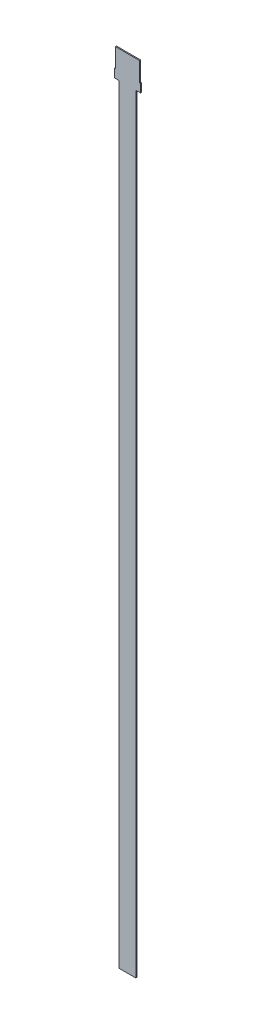
ISO-10303-21;
HEADER;
FILE_DESCRIPTION(('STEP AP214'),'2;1');
FILE_NAME('part.step','',(''),(''),'','','');
FILE_SCHEMA(('AUTOMOTIVE_DESIGN { 1 0 10303 214 1 1 1 1 }'));
ENDSEC;
DATA;
#1=APPLICATION_CONTEXT('core data for automotive mechanical design processes');
#2=APPLICATION_PROTOCOL_DEFINITION('international standard','automotive_design',2000,#1);
#3=PRODUCT_CONTEXT('',#1,'mechanical');
#4=PRODUCT('Part','Part','',(#3));
#5=PRODUCT_RELATED_PRODUCT_CATEGORY('part','',(#4));
#6=PRODUCT_DEFINITION_FORMATION('','',#4);
#7=PRODUCT_DEFINITION_CONTEXT('part definition',#1,'design');
#8=PRODUCT_DEFINITION('design','',#6,#7);
#9=PRODUCT_DEFINITION_SHAPE('','',#8);
#10=(LENGTH_UNIT() NAMED_UNIT(*) SI_UNIT(.MILLI.,.METRE.));
#11=(NAMED_UNIT(*) PLANE_ANGLE_UNIT() SI_UNIT($,.RADIAN.));
#12=(NAMED_UNIT(*) SI_UNIT($,.STERADIAN.) SOLID_ANGLE_UNIT());
#13=UNCERTAINTY_MEASURE_WITH_UNIT(LENGTH_MEASURE(1.E-05),#10,'distance_accuracy_value','');
#14=(GEOMETRIC_REPRESENTATION_CONTEXT(3) GLOBAL_UNCERTAINTY_ASSIGNED_CONTEXT((#13)) GLOBAL_UNIT_ASSIGNED_CONTEXT((#10,
#11,#12)) REPRESENTATION_CONTEXT('',''));
#15=CARTESIAN_POINT('',(0.,0.,0.));
#16=DIRECTION('',(0.,0.,1.));
#17=DIRECTION('',(1.,0.,0.));
#18=AXIS2_PLACEMENT_3D('',#15,#16,#17);
#19=CARTESIAN_POINT('',(-6.35,-607.6,0.396875));
#20=DIRECTION('',(0.,1.,0.));
#21=DIRECTION('',(0.,0.,1.));
#22=AXIS2_PLACEMENT_3D('',#19,#20,#21);
#23=PLANE('',#22);
#24=DIRECTION('',(1.,0.,0.));
#25=VECTOR('',#24,1.);
#26=CARTESIAN_POINT('',(-6.35,-607.6,-0.396875));
#27=LINE('',#26,#25);
#28=CARTESIAN_POINT('',(-6.35,-607.6,-0.396875));
#29=VERTEX_POINT('',#28);
#30=CARTESIAN_POINT('',(6.35,-607.6,-0.396875));
#31=VERTEX_POINT('',#30);
#32=EDGE_CURVE('E152',#29,#31,#27,.T.);
#33=ORIENTED_EDGE('',*,*,#32,.T.);
#34=DIRECTION('',(0.,0.,-1.));
#35=VECTOR('',#34,1.);
#36=CARTESIAN_POINT('',(6.35,-607.6,0.396875));
#37=LINE('',#36,#35);
#38=CARTESIAN_POINT('',(6.35,-607.6,0.396875));
#39=VERTEX_POINT('',#38);
#40=EDGE_CURVE('E11',#39,#31,#37,.T.);
#41=ORIENTED_EDGE('',*,*,#40,.F.);
#42=DIRECTION('',(1.,0.,0.));
#43=VECTOR('',#42,1.);
#44=CARTESIAN_POINT('',(-6.35,-607.6,0.396875));
#45=LINE('',#44,#43);
#46=CARTESIAN_POINT('',(-6.35,-607.6,0.396875));
#47=VERTEX_POINT('',#46);
#48=EDGE_CURVE('E99',#47,#39,#45,.T.);
#49=ORIENTED_EDGE('',*,*,#48,.F.);
#50=DIRECTION('',(0.,0.,-1.));
#51=VECTOR('',#50,1.);
#52=CARTESIAN_POINT('',(-6.35,-607.6,0.396875));
#53=LINE('',#52,#51);
#54=EDGE_CURVE('E49',#47,#29,#53,.T.);
#55=ORIENTED_EDGE('',*,*,#54,.T.);
#56=EDGE_LOOP('',(#33,#41,#49,#55));
#57=FACE_BOUND('',#56,.T.);
#58=ADVANCED_FACE('F33',(#57),#23,.F.);
#59=CARTESIAN_POINT('',(6.35,-21.05,0.396875));
#60=DIRECTION('',(1.,0.,0.));
#61=DIRECTION('',(0.,0.,-1.));
#62=AXIS2_PLACEMENT_3D('',#59,#60,#61);
#63=PLANE('',#62);
#64=DIRECTION('',(0.,-1.,0.));
#65=VECTOR('',#64,1.);
#66=CARTESIAN_POINT('',(6.35,-21.05,-0.396875));
#67=LINE('',#66,#65);
#68=CARTESIAN_POINT('',(6.35,-21.05,-0.396875));
#69=VERTEX_POINT('',#68);
#70=EDGE_CURVE('E154',#69,#31,#67,.T.);
#71=ORIENTED_EDGE('',*,*,#70,.F.);
#72=DIRECTION('',(0.,0.,-1.));
#73=VECTOR('',#72,1.);
#74=CARTESIAN_POINT('',(6.35,-21.05,0.396875));
#75=LINE('',#74,#73);
#76=CARTESIAN_POINT('',(6.35,-21.05,0.396875));
#77=VERTEX_POINT('',#76);
#78=EDGE_CURVE('E41',#77,#69,#75,.T.);
#79=ORIENTED_EDGE('',*,*,#78,.F.);
#80=DIRECTION('',(0.,-1.,0.));
#81=VECTOR('',#80,1.);
#82=CARTESIAN_POINT('',(6.35,-21.05,0.396875));
#83=LINE('',#82,#81);
#84=EDGE_CURVE('E218',#77,#39,#83,.T.);
#85=ORIENTED_EDGE('',*,*,#84,.T.);
#86=ORIENTED_EDGE('',*,*,#40,.T.);
#87=EDGE_LOOP('',(#71,#79,#85,#86));
#88=FACE_BOUND('',#87,.T.);
#89=ADVANCED_FACE('F206',(#88),#63,.T.);
#90=CARTESIAN_POINT('',(9.9695,-21.05,0.396875));
#91=DIRECTION('',(0.,-1.,0.));
#92=DIRECTION('',(1.,0.,0.));
#93=AXIS2_PLACEMENT_3D('',#90,#91,#92);
#94=PLANE('',#93);
#95=DIRECTION('',(-1.,0.,0.));
#96=VECTOR('',#95,1.);
#97=CARTESIAN_POINT('',(9.9695,-21.05,-0.396875));
#98=LINE('',#97,#96);
#99=CARTESIAN_POINT('',(9.9695,-21.05,-0.396875));
#100=VERTEX_POINT('',#99);
#101=EDGE_CURVE('E157',#100,#69,#98,.T.);
#102=ORIENTED_EDGE('',*,*,#101,.F.);
#103=DIRECTION('',(0.,0.,-1.));
#104=VECTOR('',#103,1.);
#105=CARTESIAN_POINT('',(9.9695,-21.05,0.396875));
#106=LINE('',#105,#104);
#107=CARTESIAN_POINT('',(9.9695,-21.05,0.396875));
#108=VERTEX_POINT('',#107);
#109=EDGE_CURVE('E196',#108,#100,#106,.T.);
#110=ORIENTED_EDGE('',*,*,#109,.F.);
#111=DIRECTION('',(-1.,0.,0.));
#112=VECTOR('',#111,1.);
#113=CARTESIAN_POINT('',(9.9695,-21.05,0.396875));
#114=LINE('',#113,#112);
#115=EDGE_CURVE('E203',#108,#77,#114,.T.);
#116=ORIENTED_EDGE('',*,*,#115,.T.);
#117=ORIENTED_EDGE('',*,*,#78,.T.);
#118=EDGE_LOOP('',(#102,#110,#116,#117));
#119=FACE_BOUND('',#118,.T.);
#120=ADVANCED_FACE('F201',(#119),#94,.T.);
#121=CARTESIAN_POINT('',(9.9695,-14.7,0.396875));
#122=DIRECTION('',(1.,0.,0.));
#123=DIRECTION('',(0.,0.,-1.));
#124=AXIS2_PLACEMENT_3D('',#121,#122,#123);
#125=PLANE('',#124);
#126=DIRECTION('',(0.,-1.,0.));
#127=VECTOR('',#126,1.);
#128=CARTESIAN_POINT('',(9.9695,-14.7,-0.396875));
#129=LINE('',#128,#127);
#130=CARTESIAN_POINT('',(9.9695,-14.7,-0.396875));
#131=VERTEX_POINT('',#130);
#132=EDGE_CURVE('E160',#131,#100,#129,.T.);
#133=ORIENTED_EDGE('',*,*,#132,.F.);
#134=DIRECTION('',(0.,0.,-1.));
#135=VECTOR('',#134,1.);
#136=CARTESIAN_POINT('',(9.9695,-14.7,0.396875));
#137=LINE('',#136,#135);
#138=CARTESIAN_POINT('',(9.9695,-14.7,0.396875));
#139=VERTEX_POINT('',#138);
#140=EDGE_CURVE('E194',#139,#131,#137,.T.);
#141=ORIENTED_EDGE('',*,*,#140,.F.);
#142=DIRECTION('',(0.,-1.,0.));
#143=VECTOR('',#142,1.);
#144=CARTESIAN_POINT('',(9.9695,-14.7,0.396875));
#145=LINE('',#144,#143);
#146=EDGE_CURVE('E215',#139,#108,#145,.T.);
#147=ORIENTED_EDGE('',*,*,#146,.T.);
#148=ORIENTED_EDGE('',*,*,#109,.T.);
#149=EDGE_LOOP('',(#133,#141,#147,#148));
#150=FACE_BOUND('',#149,.T.);
#151=ADVANCED_FACE('F212',(#150),#125,.T.);
#152=CARTESIAN_POINT('',(9.17750000000001,-14.7,0.396875));
#153=DIRECTION('',(0.,1.,0.));
#154=DIRECTION('',(-1.,0.,0.));
#155=AXIS2_PLACEMENT_3D('',#152,#153,#154);
#156=PLANE('',#155);
#157=DIRECTION('',(1.,0.,0.));
#158=VECTOR('',#157,1.);
#159=CARTESIAN_POINT('',(9.17750000000001,-14.7,-0.396875));
#160=LINE('',#159,#158);
#161=CARTESIAN_POINT('',(9.17750000000001,-14.7,-0.396875));
#162=VERTEX_POINT('',#161);
#163=EDGE_CURVE('E163',#162,#131,#160,.T.);
#164=ORIENTED_EDGE('',*,*,#163,.F.);
#165=DIRECTION('',(0.,0.,-1.));
#166=VECTOR('',#165,1.);
#167=CARTESIAN_POINT('',(9.17750000000001,-14.7,0.396875));
#168=LINE('',#167,#166);
#169=CARTESIAN_POINT('',(9.17750000000001,-14.7,0.396875));
#170=VERTEX_POINT('',#169);
#171=EDGE_CURVE('E192',#170,#162,#168,.T.);
#172=ORIENTED_EDGE('',*,*,#171,.F.);
#173=DIRECTION('',(1.,0.,0.));
#174=VECTOR('',#173,1.);
#175=CARTESIAN_POINT('',(9.17750000000001,-14.7,0.396875));
#176=LINE('',#175,#174);
#177=EDGE_CURVE('E220',#170,#139,#176,.T.);
#178=ORIENTED_EDGE('',*,*,#177,.T.);
#179=ORIENTED_EDGE('',*,*,#140,.T.);
#180=EDGE_LOOP('',(#164,#172,#178,#179));
#181=FACE_BOUND('',#180,.T.);
#182=ADVANCED_FACE('F264',(#181),#156,.T.);
#183=CARTESIAN_POINT('',(9.17750000000001,0.,0.396875));
#184=DIRECTION('',(1.,0.,0.));
#185=DIRECTION('',(0.,0.,-1.));
#186=AXIS2_PLACEMENT_3D('',#183,#184,#185);
#187=PLANE('',#186);
#188=DIRECTION('',(0.,-1.,0.));
#189=VECTOR('',#188,1.);
#190=CARTESIAN_POINT('',(9.17750000000001,0.,-0.396875));
#191=LINE('',#190,#189);
#192=CARTESIAN_POINT('',(9.17750000000001,0.,-0.396875));
#193=VERTEX_POINT('',#192);
#194=EDGE_CURVE('E166',#193,#162,#191,.T.);
#195=ORIENTED_EDGE('',*,*,#194,.F.);
#196=DIRECTION('',(0.,0.,-1.));
#197=VECTOR('',#196,1.);
#198=CARTESIAN_POINT('',(9.17750000000001,0.,0.396875));
#199=LINE('',#198,#197);
#200=CARTESIAN_POINT('',(9.17750000000001,0.,0.396875));
#201=VERTEX_POINT('',#200);
#202=EDGE_CURVE('E190',#201,#193,#199,.T.);
#203=ORIENTED_EDGE('',*,*,#202,.F.);
#204=DIRECTION('',(0.,-1.,0.));
#205=VECTOR('',#204,1.);
#206=CARTESIAN_POINT('',(9.17750000000001,0.,0.396875));
#207=LINE('',#206,#205);
#208=EDGE_CURVE('E226',#201,#170,#207,.T.);
#209=ORIENTED_EDGE('',*,*,#208,.T.);
#210=ORIENTED_EDGE('',*,*,#171,.T.);
#211=EDGE_LOOP('',(#195,#203,#209,#210));
#212=FACE_BOUND('',#211,.T.);
#213=ADVANCED_FACE('F267',(#212),#187,.T.);
#214=CARTESIAN_POINT('',(-9.17750000000001,0.,0.396875));
#215=DIRECTION('',(0.,1.,0.));
#216=DIRECTION('',(-1.,0.,0.));
#217=AXIS2_PLACEMENT_3D('',#214,#215,#216);
#218=PLANE('',#217);
#219=DIRECTION('',(1.,0.,0.));
#220=VECTOR('',#219,1.);
#221=CARTESIAN_POINT('',(-9.17750000000001,0.,-0.396875));
#222=LINE('',#221,#220);
#223=CARTESIAN_POINT('',(-9.17750000000001,0.,-0.396875));
#224=VERTEX_POINT('',#223);
#225=EDGE_CURVE('E169',#224,#193,#222,.T.);
#226=ORIENTED_EDGE('',*,*,#225,.F.);
#227=DIRECTION('',(0.,0.,-1.));
#228=VECTOR('',#227,1.);
#229=CARTESIAN_POINT('',(-9.17750000000001,0.,0.396875));
#230=LINE('',#229,#228);
#231=CARTESIAN_POINT('',(-9.17750000000001,0.,0.396875));
#232=VERTEX_POINT('',#231);
#233=EDGE_CURVE('E188',#232,#224,#230,.T.);
#234=ORIENTED_EDGE('',*,*,#233,.F.);
#235=DIRECTION('',(1.,0.,0.));
#236=VECTOR('',#235,1.);
#237=CARTESIAN_POINT('',(-9.17750000000001,0.,0.396875));
#238=LINE('',#237,#236);
#239=EDGE_CURVE('E229',#232,#201,#238,.T.);
#240=ORIENTED_EDGE('',*,*,#239,.T.);
#241=ORIENTED_EDGE('',*,*,#202,.T.);
#242=EDGE_LOOP('',(#226,#234,#240,#241));
#243=FACE_BOUND('',#242,.T.);
#244=ADVANCED_FACE('F271',(#243),#218,.T.);
#245=CARTESIAN_POINT('',(-9.17750000000001,0.,0.396875));
#246=DIRECTION('',(1.,0.,0.));
#247=DIRECTION('',(0.,1.,0.));
#248=AXIS2_PLACEMENT_3D('',#245,#246,#247);
#249=PLANE('',#248);
#250=DIRECTION('',(0.,-1.,0.));
#251=VECTOR('',#250,1.);
#252=CARTESIAN_POINT('',(-9.17750000000001,0.,-0.396875));
#253=LINE('',#252,#251);
#254=CARTESIAN_POINT('',(-9.1775,-14.7,-0.396875));
#255=VERTEX_POINT('',#254);
#256=EDGE_CURVE('E172',#224,#255,#253,.T.);
#257=ORIENTED_EDGE('',*,*,#256,.T.);
#258=DIRECTION('',(0.,0.,-1.));
#259=VECTOR('',#258,1.);
#260=CARTESIAN_POINT('',(-9.1775,-14.7,0.396875));
#261=LINE('',#260,#259);
#262=CARTESIAN_POINT('',(-9.1775,-14.7,0.396875));
#263=VERTEX_POINT('',#262);
#264=EDGE_CURVE('E185',#263,#255,#261,.T.);
#265=ORIENTED_EDGE('',*,*,#264,.F.);
#266=DIRECTION('',(0.,-1.,0.));
#267=VECTOR('',#266,1.);
#268=CARTESIAN_POINT('',(-9.17750000000001,0.,0.396875));
#269=LINE('',#268,#267);
#270=EDGE_CURVE('E232',#232,#263,#269,.T.);
#271=ORIENTED_EDGE('',*,*,#270,.F.);
#272=ORIENTED_EDGE('',*,*,#233,.T.);
#273=EDGE_LOOP('',(#257,#265,#271,#272));
#274=FACE_BOUND('',#273,.T.);
#275=ADVANCED_FACE('F238',(#274),#249,.F.);
#276=CARTESIAN_POINT('',(-9.1775,-14.7,0.396875));
#277=DIRECTION('',(0.,-1.,0.));
#278=DIRECTION('',(0.,0.,-1.));
#279=AXIS2_PLACEMENT_3D('',#276,#277,#278);
#280=PLANE('',#279);
#281=DIRECTION('',(-1.,0.,0.));
#282=VECTOR('',#281,1.);
#283=CARTESIAN_POINT('',(-9.1775,-14.7,-0.396875));
#284=LINE('',#283,#282);
#285=CARTESIAN_POINT('',(-9.9695,-14.7,-0.396875));
#286=VERTEX_POINT('',#285);
#287=EDGE_CURVE('E174',#255,#286,#284,.T.);
#288=ORIENTED_EDGE('',*,*,#287,.T.);
#289=DIRECTION('',(0.,0.,-1.));
#290=VECTOR('',#289,1.);
#291=CARTESIAN_POINT('',(-9.9695,-14.7,0.396875));
#292=LINE('',#291,#290);
#293=CARTESIAN_POINT('',(-9.9695,-14.7,0.396875));
#294=VERTEX_POINT('',#293);
#295=EDGE_CURVE('E144',#294,#286,#292,.T.);
#296=ORIENTED_EDGE('',*,*,#295,.F.);
#297=DIRECTION('',(-1.,0.,0.));
#298=VECTOR('',#297,1.);
#299=CARTESIAN_POINT('',(-9.1775,-14.7,0.396875));
#300=LINE('',#299,#298);
#301=EDGE_CURVE('E132',#263,#294,#300,.T.);
#302=ORIENTED_EDGE('',*,*,#301,.F.);
#303=ORIENTED_EDGE('',*,*,#264,.T.);
#304=EDGE_LOOP('',(#288,#296,#302,#303));
#305=FACE_BOUND('',#304,.T.);
#306=ADVANCED_FACE('F242',(#305),#280,.F.);
#307=CARTESIAN_POINT('',(-9.9695,-14.7,0.396875));
#308=DIRECTION('',(1.,0.,0.));
#309=DIRECTION('',(0.,0.,-1.));
#310=AXIS2_PLACEMENT_3D('',#307,#308,#309);
#311=PLANE('',#310);
#312=DIRECTION('',(0.,-1.,0.));
#313=VECTOR('',#312,1.);
#314=CARTESIAN_POINT('',(-9.9695,-14.7,-0.396875));
#315=LINE('',#314,#313);
#316=CARTESIAN_POINT('',(-9.9695,-21.05,-0.396875));
#317=VERTEX_POINT('',#316);
#318=EDGE_CURVE('E141',#286,#317,#315,.T.);
#319=ORIENTED_EDGE('',*,*,#318,.T.);
#320=DIRECTION('',(0.,0.,-1.));
#321=VECTOR('',#320,1.);
#322=CARTESIAN_POINT('',(-9.9695,-21.05,0.396875));
#323=LINE('',#322,#321);
#324=CARTESIAN_POINT('',(-9.9695,-21.05,0.396875));
#325=VERTEX_POINT('',#324);
#326=EDGE_CURVE('E138',#325,#317,#323,.T.);
#327=ORIENTED_EDGE('',*,*,#326,.F.);
#328=DIRECTION('',(0.,-1.,0.));
#329=VECTOR('',#328,1.);
#330=CARTESIAN_POINT('',(-9.9695,-14.7,0.396875));
#331=LINE('',#330,#329);
#332=EDGE_CURVE('E126',#294,#325,#331,.T.);
#333=ORIENTED_EDGE('',*,*,#332,.F.);
#334=ORIENTED_EDGE('',*,*,#295,.T.);
#335=EDGE_LOOP('',(#319,#327,#333,#334));
#336=FACE_BOUND('',#335,.T.);
#337=ADVANCED_FACE('F139',(#336),#311,.F.);
#338=CARTESIAN_POINT('',(-9.9695,-21.05,0.396875));
#339=DIRECTION('',(0.,1.,0.));
#340=DIRECTION('',(-1.,0.,0.));
#341=AXIS2_PLACEMENT_3D('',#338,#339,#340);
#342=PLANE('',#341);
#343=DIRECTION('',(1.,0.,0.));
#344=VECTOR('',#343,1.);
#345=CARTESIAN_POINT('',(-9.9695,-21.05,-0.396875));
#346=LINE('',#345,#344);
#347=CARTESIAN_POINT('',(-6.35,-21.05,-0.396875));
#348=VERTEX_POINT('',#347);
#349=EDGE_CURVE('E177',#317,#348,#346,.T.);
#350=ORIENTED_EDGE('',*,*,#349,.T.);
#351=DIRECTION('',(0.,0.,-1.));
#352=VECTOR('',#351,1.);
#353=CARTESIAN_POINT('',(-6.35,-21.05,0.396875));
#354=LINE('',#353,#352);
#355=CARTESIAN_POINT('',(-6.35,-21.05,0.396875));
#356=VERTEX_POINT('',#355);
#357=EDGE_CURVE('E87',#356,#348,#354,.T.);
#358=ORIENTED_EDGE('',*,*,#357,.F.);
#359=DIRECTION('',(1.,0.,0.));
#360=VECTOR('',#359,1.);
#361=CARTESIAN_POINT('',(-9.9695,-21.05,0.396875));
#362=LINE('',#361,#360);
#363=EDGE_CURVE('E130',#325,#356,#362,.T.);
#364=ORIENTED_EDGE('',*,*,#363,.F.);
#365=ORIENTED_EDGE('',*,*,#326,.T.);
#366=EDGE_LOOP('',(#350,#358,#364,#365));
#367=FACE_BOUND('',#366,.T.);
#368=ADVANCED_FACE('F146',(#367),#342,.F.);
#369=CARTESIAN_POINT('',(-6.35,-607.6,0.396875));
#370=DIRECTION('',(-1.,0.,0.));
#371=DIRECTION('',(0.,0.,1.));
#372=AXIS2_PLACEMENT_3D('',#369,#370,#371);
#373=PLANE('',#372);
#374=DIRECTION('',(0.,1.,0.));
#375=VECTOR('',#374,1.);
#376=CARTESIAN_POINT('',(-6.35,-607.6,-0.396875));
#377=LINE('',#376,#375);
#378=EDGE_CURVE('E179',#29,#348,#377,.T.);
#379=ORIENTED_EDGE('',*,*,#378,.F.);
#380=ORIENTED_EDGE('',*,*,#54,.F.);
#381=DIRECTION('',(0.,1.,0.));
#382=VECTOR('',#381,1.);
#383=CARTESIAN_POINT('',(-6.35,-607.6,0.396875));
#384=LINE('',#383,#382);
#385=EDGE_CURVE('E147',#47,#356,#384,.T.);
#386=ORIENTED_EDGE('',*,*,#385,.T.);
#387=ORIENTED_EDGE('',*,*,#357,.T.);
#388=EDGE_LOOP('',(#379,#380,#386,#387));
#389=FACE_BOUND('',#388,.T.);
#390=ADVANCED_FACE('F243',(#389),#373,.T.);
#391=CARTESIAN_POINT('',(0.,0.,0.396875));
#392=DIRECTION('',(0.,0.,-1.));
#393=DIRECTION('',(-1.,0.,0.));
#394=AXIS2_PLACEMENT_3D('',#391,#392,#393);
#395=PLANE('',#394);
#396=ORIENTED_EDGE('',*,*,#48,.T.);
#397=ORIENTED_EDGE('',*,*,#84,.F.);
#398=ORIENTED_EDGE('',*,*,#115,.F.);
#399=ORIENTED_EDGE('',*,*,#146,.F.);
#400=ORIENTED_EDGE('',*,*,#177,.F.);
#401=ORIENTED_EDGE('',*,*,#208,.F.);
#402=ORIENTED_EDGE('',*,*,#239,.F.);
#403=ORIENTED_EDGE('',*,*,#270,.T.);
#404=ORIENTED_EDGE('',*,*,#301,.T.);
#405=ORIENTED_EDGE('',*,*,#332,.T.);
#406=ORIENTED_EDGE('',*,*,#363,.T.);
#407=ORIENTED_EDGE('',*,*,#385,.F.);
#408=EDGE_LOOP('',(#396,#397,#398,#399,#400,#401,#402,#403,#404,#405,#406,#407));
#409=FACE_BOUND('',#408,.T.);
#410=ADVANCED_FACE('F128',(#409),#395,.F.);
#411=CARTESIAN_POINT('',(0.,0.,-0.396875));
#412=DIRECTION('',(0.,0.,-1.));
#413=DIRECTION('',(-1.,0.,0.));
#414=AXIS2_PLACEMENT_3D('',#411,#412,#413);
#415=PLANE('',#414);
#416=ORIENTED_EDGE('',*,*,#32,.F.);
#417=ORIENTED_EDGE('',*,*,#378,.T.);
#418=ORIENTED_EDGE('',*,*,#349,.F.);
#419=ORIENTED_EDGE('',*,*,#318,.F.);
#420=ORIENTED_EDGE('',*,*,#287,.F.);
#421=ORIENTED_EDGE('',*,*,#256,.F.);
#422=ORIENTED_EDGE('',*,*,#225,.T.);
#423=ORIENTED_EDGE('',*,*,#194,.T.);
#424=ORIENTED_EDGE('',*,*,#163,.T.);
#425=ORIENTED_EDGE('',*,*,#132,.T.);
#426=ORIENTED_EDGE('',*,*,#101,.T.);
#427=ORIENTED_EDGE('',*,*,#70,.T.);
#428=EDGE_LOOP('',(#416,#417,#418,#419,#420,#421,#422,#423,#424,#425,#426,#427));
#429=FACE_BOUND('',#428,.T.);
#430=ADVANCED_FACE('F208',(#429),#415,.T.);
#431=CLOSED_SHELL('',(#58,#89,#120,#151,#182,#213,#244,#275,#306,#337,#368,#390,#410,#430));
#432=MANIFOLD_SOLID_BREP('B2',#431);
#433=ADVANCED_BREP_SHAPE_REPRESENTATION('',(#18,#432),#14);
#434=SHAPE_DEFINITION_REPRESENTATION(#9,#433);
ENDSEC;
END-ISO-10303-21;
